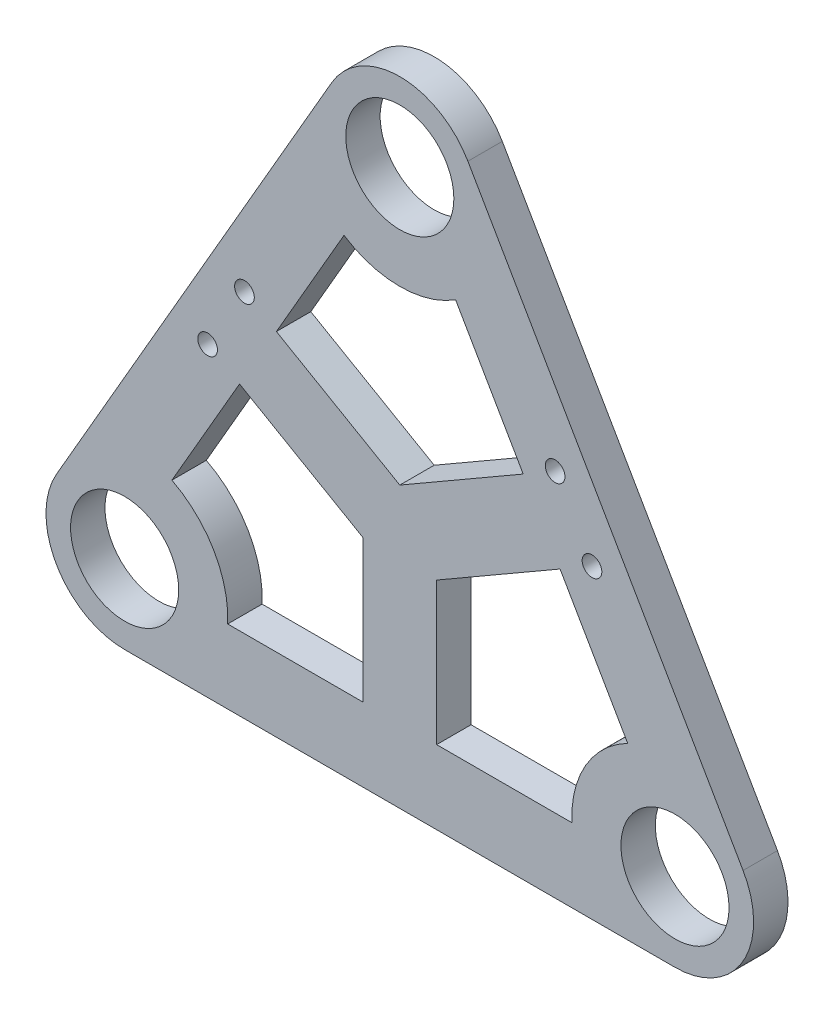
ISO-10303-21;
HEADER;
FILE_DESCRIPTION(('STEP AP214'),'2;1');
FILE_NAME('part.step','',(''),(''),'','','');
FILE_SCHEMA(('AUTOMOTIVE_DESIGN { 1 0 10303 214 1 1 1 1 }'));
ENDSEC;
DATA;
#1=APPLICATION_CONTEXT('core data for automotive mechanical design processes');
#2=APPLICATION_PROTOCOL_DEFINITION('international standard','automotive_design',2000,#1);
#3=PRODUCT_CONTEXT('',#1,'mechanical');
#4=PRODUCT('Part','Part','',(#3));
#5=PRODUCT_RELATED_PRODUCT_CATEGORY('part','',(#4));
#6=PRODUCT_DEFINITION_FORMATION('','',#4);
#7=PRODUCT_DEFINITION_CONTEXT('part definition',#1,'design');
#8=PRODUCT_DEFINITION('design','',#6,#7);
#9=PRODUCT_DEFINITION_SHAPE('','',#8);
#10=(LENGTH_UNIT() NAMED_UNIT(*) SI_UNIT(.MILLI.,.METRE.));
#11=(NAMED_UNIT(*) PLANE_ANGLE_UNIT() SI_UNIT($,.RADIAN.));
#12=(NAMED_UNIT(*) SI_UNIT($,.STERADIAN.) SOLID_ANGLE_UNIT());
#13=UNCERTAINTY_MEASURE_WITH_UNIT(LENGTH_MEASURE(1.E-05),#10,'distance_accuracy_value','');
#14=(GEOMETRIC_REPRESENTATION_CONTEXT(3) GLOBAL_UNCERTAINTY_ASSIGNED_CONTEXT((#13)) GLOBAL_UNIT_ASSIGNED_CONTEXT((#10,
#11,#12)) REPRESENTATION_CONTEXT('',''));
#15=CARTESIAN_POINT('',(0.,0.,0.));
#16=DIRECTION('',(0.,0.,1.));
#17=DIRECTION('',(1.,0.,0.));
#18=AXIS2_PLACEMENT_3D('',#15,#16,#17);
#19=CARTESIAN_POINT('',(56.,96.9948452238571,7.));
#20=DIRECTION('',(0.,0.,1.));
#21=DIRECTION('',(1.,0.,0.));
#22=AXIS2_PLACEMENT_3D('',#19,#20,#21);
#23=PLANE('',#22);
#24=CARTESIAN_POINT('',(95.1112159321677,46.2522320835453,7.));
#25=DIRECTION('',(0.,0.,1.));
#26=DIRECTION('',(1.,0.,0.));
#27=AXIS2_PLACEMENT_3D('',#24,#25,#26);
#28=CIRCLE('',#27,2.);
#29=CARTESIAN_POINT('',(97.1112159321677,46.2522320835453,7.));
#30=VERTEX_POINT('',#29);
#31=EDGE_CURVE('E600',#30,#30,#28,.T.);
#32=ORIENTED_EDGE('',*,*,#31,.F.);
#33=EDGE_LOOP('',(#32));
#34=FACE_BOUND('',#33,.T.);
#35=CARTESIAN_POINT('',(87.6112159321677,59.2426131403119,7.));
#36=DIRECTION('',(0.,0.,1.));
#37=DIRECTION('',(1.,0.,0.));
#38=AXIS2_PLACEMENT_3D('',#35,#36,#37);
#39=CIRCLE('',#38,2.);
#40=CARTESIAN_POINT('',(89.6112159321677,59.2426131403119,7.));
#41=VERTEX_POINT('',#40);
#42=EDGE_CURVE('E590',#41,#41,#39,.T.);
#43=ORIENTED_EDGE('',*,*,#42,.F.);
#44=EDGE_LOOP('',(#43));
#45=FACE_BOUND('',#44,.T.);
#46=CARTESIAN_POINT('',(16.8887840678323,46.2522320835453,7.));
#47=DIRECTION('',(0.,0.,1.));
#48=DIRECTION('',(1.,0.,0.));
#49=AXIS2_PLACEMENT_3D('',#46,#47,#48);
#50=CIRCLE('',#49,2.00000000000001);
#51=CARTESIAN_POINT('',(18.8887840678323,46.2522320835453,7.));
#52=VERTEX_POINT('',#51);
#53=EDGE_CURVE('E581',#52,#52,#50,.T.);
#54=ORIENTED_EDGE('',*,*,#53,.F.);
#55=EDGE_LOOP('',(#54));
#56=FACE_BOUND('',#55,.T.);
#57=CARTESIAN_POINT('',(24.3887840678323,59.2426131403119,7.));
#58=DIRECTION('',(0.,0.,1.));
#59=DIRECTION('',(1.,0.,0.));
#60=AXIS2_PLACEMENT_3D('',#57,#58,#59);
#61=CIRCLE('',#60,2.);
#62=CARTESIAN_POINT('',(26.3887840678323,59.2426131403119,7.));
#63=VERTEX_POINT('',#62);
#64=EDGE_CURVE('E221',#63,#63,#61,.T.);
#65=ORIENTED_EDGE('',*,*,#64,.F.);
#66=EDGE_LOOP('',(#65));
#67=FACE_BOUND('',#66,.T.);
#68=DIRECTION('',(0.,-1.,0.));
#69=VECTOR('',#68,1.);
#70=CARTESIAN_POINT('',(63.5,-0.999999999999997,7.));
#71=LINE('',#70,#69);
#72=CARTESIAN_POINT('',(63.5,28.0014880556968,7.));
#73=VERTEX_POINT('',#72);
#74=CARTESIAN_POINT('',(63.5,-1.,7.));
#75=VERTEX_POINT('',#74);
#76=EDGE_CURVE('E61',#73,#75,#71,.T.);
#77=ORIENTED_EDGE('',*,*,#76,.F.);
#78=DIRECTION('',(-0.866025403784438,-0.5,0.));
#79=VECTOR('',#78,1.);
#80=CARTESIAN_POINT('',(63.5,28.0014880556968,7.));
#81=LINE('',#80,#79);
#82=CARTESIAN_POINT('',(88.6160254037844,42.5022320835453,7.));
#83=VERTEX_POINT('',#82);
#84=EDGE_CURVE('E260',#83,#73,#81,.T.);
#85=ORIENTED_EDGE('',*,*,#84,.F.);
#86=DIRECTION('',(-0.5,0.866025403784439,0.));
#87=VECTOR('',#86,1.);
#88=CARTESIAN_POINT('',(88.6160254037844,42.5022320835453,7.));
#89=LINE('',#88,#87);
#90=CARTESIAN_POINT('',(102.377936922083,18.6659021245849,7.));
#91=VERTEX_POINT('',#90);
#92=EDGE_CURVE('E287',#91,#83,#89,.T.);
#93=ORIENTED_EDGE('',*,*,#92,.F.);
#94=CARTESIAN_POINT('',(112.,0.,7.));
#95=DIRECTION('',(0.,0.,-1.));
#96=DIRECTION('',(1.,0.,0.));
#97=AXIS2_PLACEMENT_3D('',#94,#95,#96);
#98=CIRCLE('',#97,21.);
#99=CARTESIAN_POINT('',(91.023823036597,-0.999999999999997,7.));
#100=VERTEX_POINT('',#99);
#101=EDGE_CURVE('E283',#100,#91,#98,.T.);
#102=ORIENTED_EDGE('',*,*,#101,.F.);
#103=DIRECTION('',(1.,0.,0.));
#104=VECTOR('',#103,1.);
#105=CARTESIAN_POINT('',(63.5,-0.999999999999997,7.));
#106=LINE('',#105,#104);
#107=EDGE_CURVE('E279',#75,#100,#106,.T.);
#108=ORIENTED_EDGE('',*,*,#107,.F.);
#109=EDGE_LOOP('',(#77,#85,#93,#102,#108));
#110=FACE_BOUND('',#109,.T.);
#111=DIRECTION('',(0.866025403784439,-0.5,0.));
#112=VECTOR('',#111,1.);
#113=CARTESIAN_POINT('',(30.8839745962155,55.4926131403119,7.));
#114=LINE('',#113,#112);
#115=CARTESIAN_POINT('',(30.8839745962155,55.4926131403119,7.));
#116=VERTEX_POINT('',#115);
#117=CARTESIAN_POINT('',(56.,40.9918691124634,7.));
#118=VERTEX_POINT('',#117);
#119=EDGE_CURVE('E69',#116,#118,#114,.T.);
#120=ORIENTED_EDGE('',*,*,#119,.F.);
#121=DIRECTION('',(-0.5,-0.866025403784439,0.));
#122=VECTOR('',#121,1.);
#123=CARTESIAN_POINT('',(30.8839745962155,55.4926131403119,7.));
#124=LINE('',#123,#122);
#125=CARTESIAN_POINT('',(44.645886114514,79.3289430992722,7.));
#126=VERTEX_POINT('',#125);
#127=EDGE_CURVE('E214',#126,#116,#124,.T.);
#128=ORIENTED_EDGE('',*,*,#127,.F.);
#129=CARTESIAN_POINT('',(56.,96.9948452238571,7.));
#130=DIRECTION('',(0.,0.,-1.));
#131=DIRECTION('',(1.,0.,0.));
#132=AXIS2_PLACEMENT_3D('',#129,#130,#131);
#133=CIRCLE('',#132,21.);
#134=CARTESIAN_POINT('',(67.3541138854859,79.3289430992722,7.));
#135=VERTEX_POINT('',#134);
#136=EDGE_CURVE('E218',#135,#126,#133,.T.);
#137=ORIENTED_EDGE('',*,*,#136,.F.);
#138=DIRECTION('',(-0.5,0.866025403784439,0.));
#139=VECTOR('',#138,1.);
#140=CARTESIAN_POINT('',(81.1160254037844,55.4926131403119,7.));
#141=LINE('',#140,#139);
#142=CARTESIAN_POINT('',(81.1160254037844,55.4926131403119,7.));
#143=VERTEX_POINT('',#142);
#144=EDGE_CURVE('E237',#143,#135,#141,.T.);
#145=ORIENTED_EDGE('',*,*,#144,.F.);
#146=DIRECTION('',(0.866025403784438,0.5,0.));
#147=VECTOR('',#146,1.);
#148=CARTESIAN_POINT('',(56.,40.9918691124634,7.));
#149=LINE('',#148,#147);
#150=EDGE_CURVE('E233',#118,#143,#149,.T.);
#151=ORIENTED_EDGE('',*,*,#150,.F.);
#152=EDGE_LOOP('',(#120,#128,#137,#145,#151));
#153=FACE_BOUND('',#152,.T.);
#154=CARTESIAN_POINT('',(0.,0.,7.));
#155=DIRECTION('',(0.,0.,-1.));
#156=DIRECTION('',(1.,0.,0.));
#157=AXIS2_PLACEMENT_3D('',#154,#155,#156);
#158=CIRCLE('',#157,21.);
#159=CARTESIAN_POINT('',(9.62206307791709,18.6659021245849,7.));
#160=VERTEX_POINT('',#159);
#161=CARTESIAN_POINT('',(20.976176963403,-1.00000000000001,7.));
#162=VERTEX_POINT('',#161);
#163=EDGE_CURVE('E297',#160,#162,#158,.T.);
#164=ORIENTED_EDGE('',*,*,#163,.F.);
#165=DIRECTION('',(-0.499999999999999,-0.866025403784439,0.));
#166=VECTOR('',#165,1.);
#167=CARTESIAN_POINT('',(9.62206307791709,18.6659021245849,7.));
#168=LINE('',#167,#166);
#169=CARTESIAN_POINT('',(23.3839745962156,42.5022320835453,7.));
#170=VERTEX_POINT('',#169);
#171=EDGE_CURVE('E314',#170,#160,#168,.T.);
#172=ORIENTED_EDGE('',*,*,#171,.F.);
#173=DIRECTION('',(-0.866025403784439,0.5,0.));
#174=VECTOR('',#173,1.);
#175=CARTESIAN_POINT('',(23.3839745962156,42.5022320835453,7.));
#176=LINE('',#175,#174);
#177=CARTESIAN_POINT('',(48.5,28.0014880556969,7.));
#178=VERTEX_POINT('',#177);
#179=EDGE_CURVE('E341',#178,#170,#176,.T.);
#180=ORIENTED_EDGE('',*,*,#179,.F.);
#181=DIRECTION('',(0.,1.,0.));
#182=VECTOR('',#181,1.);
#183=CARTESIAN_POINT('',(48.5,28.0014880556969,7.));
#184=LINE('',#183,#182);
#185=CARTESIAN_POINT('',(48.5,-0.999999999999997,7.));
#186=VERTEX_POINT('',#185);
#187=EDGE_CURVE('E337',#186,#178,#184,.T.);
#188=ORIENTED_EDGE('',*,*,#187,.F.);
#189=DIRECTION('',(1.,0.,0.));
#190=VECTOR('',#189,1.);
#191=CARTESIAN_POINT('',(48.5,-0.999999999999997,7.));
#192=LINE('',#191,#190);
#193=EDGE_CURVE('E333',#162,#186,#192,.T.);
#194=ORIENTED_EDGE('',*,*,#193,.F.);
#195=EDGE_LOOP('',(#164,#172,#180,#188,#194));
#196=FACE_BOUND('',#195,.T.);
#197=CARTESIAN_POINT('',(112.,0.,7.));
#198=DIRECTION('',(0.,0.,1.));
#199=DIRECTION('',(1.,0.,0.));
#200=AXIS2_PLACEMENT_3D('',#197,#198,#199);
#201=CIRCLE('',#200,11.);
#202=CARTESIAN_POINT('',(123.,0.,7.));
#203=VERTEX_POINT('',#202);
#204=EDGE_CURVE('E372',#203,#203,#201,.T.);
#205=ORIENTED_EDGE('',*,*,#204,.F.);
#206=EDGE_LOOP('',(#205));
#207=FACE_BOUND('',#206,.T.);
#208=CARTESIAN_POINT('',(56.,96.9948452238571,7.));
#209=DIRECTION('',(0.,0.,1.));
#210=DIRECTION('',(1.,0.,0.));
#211=AXIS2_PLACEMENT_3D('',#208,#209,#210);
#212=CIRCLE('',#211,16.);
#213=CARTESIAN_POINT('',(69.856406460551,104.994845223857,7.));
#214=VERTEX_POINT('',#213);
#215=CARTESIAN_POINT('',(42.143593539449,104.994845223857,7.));
#216=VERTEX_POINT('',#215);
#217=EDGE_CURVE('E388',#214,#216,#212,.T.);
#218=ORIENTED_EDGE('',*,*,#217,.T.);
#219=DIRECTION('',(-0.5,-0.866025403784439,0.));
#220=VECTOR('',#219,1.);
#221=CARTESIAN_POINT('',(42.143593539449,104.994845223857,7.));
#222=LINE('',#221,#220);
#223=CARTESIAN_POINT('',(-13.856406460551,8.,7.));
#224=VERTEX_POINT('',#223);
#225=EDGE_CURVE('E392',#216,#224,#222,.T.);
#226=ORIENTED_EDGE('',*,*,#225,.T.);
#227=CARTESIAN_POINT('',(0.,0.,7.));
#228=DIRECTION('',(0.,0.,1.));
#229=DIRECTION('',(1.,0.,0.));
#230=AXIS2_PLACEMENT_3D('',#227,#228,#229);
#231=CIRCLE('',#230,16.);
#232=CARTESIAN_POINT('',(0.,-16.,7.));
#233=VERTEX_POINT('',#232);
#234=EDGE_CURVE('E396',#224,#233,#231,.T.);
#235=ORIENTED_EDGE('',*,*,#234,.T.);
#236=DIRECTION('',(1.,0.,0.));
#237=VECTOR('',#236,1.);
#238=CARTESIAN_POINT('',(0.,-16.,7.));
#239=LINE('',#238,#237);
#240=CARTESIAN_POINT('',(112.,-16.,7.));
#241=VERTEX_POINT('',#240);
#242=EDGE_CURVE('E399',#233,#241,#239,.T.);
#243=ORIENTED_EDGE('',*,*,#242,.T.);
#244=CARTESIAN_POINT('',(112.,0.,7.));
#245=DIRECTION('',(0.,0.,1.));
#246=DIRECTION('',(1.,0.,0.));
#247=AXIS2_PLACEMENT_3D('',#244,#245,#246);
#248=CIRCLE('',#247,16.);
#249=CARTESIAN_POINT('',(125.856406460551,8.,7.));
#250=VERTEX_POINT('',#249);
#251=EDGE_CURVE('E402',#241,#250,#248,.T.);
#252=ORIENTED_EDGE('',*,*,#251,.T.);
#253=DIRECTION('',(-0.5,0.866025403784438,0.));
#254=VECTOR('',#253,1.);
#255=CARTESIAN_POINT('',(69.856406460551,104.994845223857,7.));
#256=LINE('',#255,#254);
#257=EDGE_CURVE('E405',#250,#214,#256,.T.);
#258=ORIENTED_EDGE('',*,*,#257,.T.);
#259=EDGE_LOOP('',(#218,#226,#235,#243,#252,#258));
#260=FACE_BOUND('',#259,.T.);
#261=CARTESIAN_POINT('',(0.,0.,7.));
#262=DIRECTION('',(0.,0.,1.));
#263=DIRECTION('',(1.,0.,0.));
#264=AXIS2_PLACEMENT_3D('',#261,#262,#263);
#265=CIRCLE('',#264,11.);
#266=CARTESIAN_POINT('',(11.,0.,7.));
#267=VERTEX_POINT('',#266);
#268=EDGE_CURVE('E380',#267,#267,#265,.T.);
#269=ORIENTED_EDGE('',*,*,#268,.F.);
#270=EDGE_LOOP('',(#269));
#271=FACE_BOUND('',#270,.T.);
#272=CARTESIAN_POINT('',(56.,96.9948452238571,7.));
#273=DIRECTION('',(0.,0.,1.));
#274=DIRECTION('',(1.,0.,0.));
#275=AXIS2_PLACEMENT_3D('',#272,#273,#274);
#276=CIRCLE('',#275,11.);
#277=CARTESIAN_POINT('',(67.,96.9948452238571,7.));
#278=VERTEX_POINT('',#277);
#279=EDGE_CURVE('E364',#278,#278,#276,.T.);
#280=ORIENTED_EDGE('',*,*,#279,.F.);
#281=EDGE_LOOP('',(#280));
#282=FACE_BOUND('',#281,.T.);
#283=ADVANCED_FACE('F45',(#34,#45,#56,#67,#110,#153,#196,#207,#260,#271,#282),#23,.T.);
#284=CARTESIAN_POINT('',(56.,96.9948452238571,0.));
#285=DIRECTION('',(0.,0.,1.));
#286=DIRECTION('',(1.,0.,0.));
#287=AXIS2_PLACEMENT_3D('',#284,#285,#286);
#288=PLANE('',#287);
#289=CARTESIAN_POINT('',(95.1112159321677,46.2522320835453,0.));
#290=DIRECTION('',(0.,0.,1.));
#291=DIRECTION('',(1.,0.,0.));
#292=AXIS2_PLACEMENT_3D('',#289,#290,#291);
#293=CIRCLE('',#292,2.);
#294=CARTESIAN_POINT('',(97.1112159321677,46.2522320835453,0.));
#295=VERTEX_POINT('',#294);
#296=EDGE_CURVE('E596',#295,#295,#293,.T.);
#297=ORIENTED_EDGE('',*,*,#296,.T.);
#298=EDGE_LOOP('',(#297));
#299=FACE_BOUND('',#298,.T.);
#300=CARTESIAN_POINT('',(87.6112159321677,59.2426131403119,0.));
#301=DIRECTION('',(0.,0.,1.));
#302=DIRECTION('',(1.,0.,0.));
#303=AXIS2_PLACEMENT_3D('',#300,#301,#302);
#304=CIRCLE('',#303,2.);
#305=CARTESIAN_POINT('',(89.6112159321677,59.2426131403119,0.));
#306=VERTEX_POINT('',#305);
#307=EDGE_CURVE('E584',#306,#306,#304,.T.);
#308=ORIENTED_EDGE('',*,*,#307,.T.);
#309=EDGE_LOOP('',(#308));
#310=FACE_BOUND('',#309,.T.);
#311=CARTESIAN_POINT('',(16.8887840678323,46.2522320835453,0.));
#312=DIRECTION('',(0.,0.,1.));
#313=DIRECTION('',(1.,0.,0.));
#314=AXIS2_PLACEMENT_3D('',#311,#312,#313);
#315=CIRCLE('',#314,2.00000000000001);
#316=CARTESIAN_POINT('',(18.8887840678323,46.2522320835453,0.));
#317=VERTEX_POINT('',#316);
#318=EDGE_CURVE('E578',#317,#317,#315,.T.);
#319=ORIENTED_EDGE('',*,*,#318,.T.);
#320=EDGE_LOOP('',(#319));
#321=FACE_BOUND('',#320,.T.);
#322=CARTESIAN_POINT('',(24.3887840678323,59.2426131403119,0.));
#323=DIRECTION('',(0.,0.,1.));
#324=DIRECTION('',(1.,0.,0.));
#325=AXIS2_PLACEMENT_3D('',#322,#323,#324);
#326=CIRCLE('',#325,2.);
#327=CARTESIAN_POINT('',(26.3887840678323,59.2426131403119,0.));
#328=VERTEX_POINT('',#327);
#329=EDGE_CURVE('E234',#328,#328,#326,.T.);
#330=ORIENTED_EDGE('',*,*,#329,.T.);
#331=EDGE_LOOP('',(#330));
#332=FACE_BOUND('',#331,.T.);
#333=DIRECTION('',(-0.866025403784438,-0.5,0.));
#334=VECTOR('',#333,1.);
#335=CARTESIAN_POINT('',(63.5,28.0014880556968,0.));
#336=LINE('',#335,#334);
#337=CARTESIAN_POINT('',(88.6160254037844,42.5022320835453,0.));
#338=VERTEX_POINT('',#337);
#339=CARTESIAN_POINT('',(63.5,28.0014880556968,0.));
#340=VERTEX_POINT('',#339);
#341=EDGE_CURVE('E272',#338,#340,#336,.T.);
#342=ORIENTED_EDGE('',*,*,#341,.T.);
#343=DIRECTION('',(0.,-1.,0.));
#344=VECTOR('',#343,1.);
#345=CARTESIAN_POINT('',(63.5,-0.999999999999997,0.));
#346=LINE('',#345,#344);
#347=CARTESIAN_POINT('',(63.5,-0.999999999999997,0.));
#348=VERTEX_POINT('',#347);
#349=EDGE_CURVE('E255',#340,#348,#346,.T.);
#350=ORIENTED_EDGE('',*,*,#349,.T.);
#351=DIRECTION('',(1.,0.,0.));
#352=VECTOR('',#351,1.);
#353=CARTESIAN_POINT('',(63.5,-0.999999999999997,0.));
#354=LINE('',#353,#352);
#355=CARTESIAN_POINT('',(91.023823036597,-1.,0.));
#356=VERTEX_POINT('',#355);
#357=EDGE_CURVE('E259',#348,#356,#354,.T.);
#358=ORIENTED_EDGE('',*,*,#357,.T.);
#359=CARTESIAN_POINT('',(112.,0.,0.));
#360=DIRECTION('',(0.,0.,-1.));
#361=DIRECTION('',(1.,0.,0.));
#362=AXIS2_PLACEMENT_3D('',#359,#360,#361);
#363=CIRCLE('',#362,21.);
#364=CARTESIAN_POINT('',(102.377936922083,18.6659021245849,0.));
#365=VERTEX_POINT('',#364);
#366=EDGE_CURVE('E264',#356,#365,#363,.T.);
#367=ORIENTED_EDGE('',*,*,#366,.T.);
#368=DIRECTION('',(-0.5,0.866025403784439,0.));
#369=VECTOR('',#368,1.);
#370=CARTESIAN_POINT('',(88.6160254037844,42.5022320835453,0.));
#371=LINE('',#370,#369);
#372=EDGE_CURVE('E268',#365,#338,#371,.T.);
#373=ORIENTED_EDGE('',*,*,#372,.T.);
#374=EDGE_LOOP('',(#342,#350,#358,#367,#373));
#375=FACE_BOUND('',#374,.T.);
#376=DIRECTION('',(-0.5,-0.866025403784439,0.));
#377=VECTOR('',#376,1.);
#378=CARTESIAN_POINT('',(30.8839745962155,55.4926131403119,0.));
#379=LINE('',#378,#377);
#380=CARTESIAN_POINT('',(44.645886114514,79.3289430992722,0.));
#381=VERTEX_POINT('',#380);
#382=CARTESIAN_POINT('',(30.8839745962155,55.4926131403119,0.));
#383=VERTEX_POINT('',#382);
#384=EDGE_CURVE('E198',#381,#383,#379,.T.);
#385=ORIENTED_EDGE('',*,*,#384,.T.);
#386=DIRECTION('',(0.866025403784439,-0.5,0.));
#387=VECTOR('',#386,1.);
#388=CARTESIAN_POINT('',(30.8839745962155,55.4926131403119,0.));
#389=LINE('',#388,#387);
#390=CARTESIAN_POINT('',(56.,40.9918691124634,0.));
#391=VERTEX_POINT('',#390);
#392=EDGE_CURVE('E191',#383,#391,#389,.T.);
#393=ORIENTED_EDGE('',*,*,#392,.T.);
#394=DIRECTION('',(0.866025403784438,0.5,0.));
#395=VECTOR('',#394,1.);
#396=CARTESIAN_POINT('',(56.,40.9918691124634,0.));
#397=LINE('',#396,#395);
#398=CARTESIAN_POINT('',(81.1160254037844,55.4926131403119,0.));
#399=VERTEX_POINT('',#398);
#400=EDGE_CURVE('E202',#391,#399,#397,.T.);
#401=ORIENTED_EDGE('',*,*,#400,.T.);
#402=DIRECTION('',(-0.5,0.866025403784439,0.));
#403=VECTOR('',#402,1.);
#404=CARTESIAN_POINT('',(81.1160254037844,55.4926131403119,0.));
#405=LINE('',#404,#403);
#406=CARTESIAN_POINT('',(67.3541138854859,79.3289430992722,0.));
#407=VERTEX_POINT('',#406);
#408=EDGE_CURVE('E207',#399,#407,#405,.T.);
#409=ORIENTED_EDGE('',*,*,#408,.T.);
#410=CARTESIAN_POINT('',(56.,96.9948452238571,0.));
#411=DIRECTION('',(0.,0.,-1.));
#412=DIRECTION('',(1.,0.,0.));
#413=AXIS2_PLACEMENT_3D('',#410,#411,#412);
#414=CIRCLE('',#413,21.);
#415=EDGE_CURVE('E226',#407,#381,#414,.T.);
#416=ORIENTED_EDGE('',*,*,#415,.T.);
#417=EDGE_LOOP('',(#385,#393,#401,#409,#416));
#418=FACE_BOUND('',#417,.T.);
#419=DIRECTION('',(-0.499999999999999,-0.866025403784439,0.));
#420=VECTOR('',#419,1.);
#421=CARTESIAN_POINT('',(9.62206307791709,18.6659021245849,0.));
#422=LINE('',#421,#420);
#423=CARTESIAN_POINT('',(23.3839745962156,42.5022320835453,0.));
#424=VERTEX_POINT('',#423);
#425=CARTESIAN_POINT('',(9.62206307791709,18.6659021245849,0.));
#426=VERTEX_POINT('',#425);
#427=EDGE_CURVE('E326',#424,#426,#422,.T.);
#428=ORIENTED_EDGE('',*,*,#427,.T.);
#429=CARTESIAN_POINT('',(0.,0.,0.));
#430=DIRECTION('',(0.,0.,-1.));
#431=DIRECTION('',(1.,0.,0.));
#432=AXIS2_PLACEMENT_3D('',#429,#430,#431);
#433=CIRCLE('',#432,21.);
#434=CARTESIAN_POINT('',(20.976176963403,-1.,0.));
#435=VERTEX_POINT('',#434);
#436=EDGE_CURVE('E309',#426,#435,#433,.T.);
#437=ORIENTED_EDGE('',*,*,#436,.T.);
#438=DIRECTION('',(1.,0.,0.));
#439=VECTOR('',#438,1.);
#440=CARTESIAN_POINT('',(48.5,-0.999999999999997,0.));
#441=LINE('',#440,#439);
#442=CARTESIAN_POINT('',(48.5,-1.,0.));
#443=VERTEX_POINT('',#442);
#444=EDGE_CURVE('E313',#435,#443,#441,.T.);
#445=ORIENTED_EDGE('',*,*,#444,.T.);
#446=DIRECTION('',(0.,1.,0.));
#447=VECTOR('',#446,1.);
#448=CARTESIAN_POINT('',(48.5,28.0014880556969,0.));
#449=LINE('',#448,#447);
#450=CARTESIAN_POINT('',(48.5,28.0014880556969,0.));
#451=VERTEX_POINT('',#450);
#452=EDGE_CURVE('E318',#443,#451,#449,.T.);
#453=ORIENTED_EDGE('',*,*,#452,.T.);
#454=DIRECTION('',(-0.866025403784439,0.5,0.));
#455=VECTOR('',#454,1.);
#456=CARTESIAN_POINT('',(23.3839745962156,42.5022320835453,0.));
#457=LINE('',#456,#455);
#458=EDGE_CURVE('E322',#451,#424,#457,.T.);
#459=ORIENTED_EDGE('',*,*,#458,.T.);
#460=EDGE_LOOP('',(#428,#437,#445,#453,#459));
#461=FACE_BOUND('',#460,.T.);
#462=CARTESIAN_POINT('',(56.,96.9948452238571,0.));
#463=DIRECTION('',(0.,0.,1.));
#464=DIRECTION('',(1.,0.,0.));
#465=AXIS2_PLACEMENT_3D('',#462,#463,#464);
#466=CIRCLE('',#465,16.);
#467=CARTESIAN_POINT('',(69.856406460551,104.994845223857,0.));
#468=VERTEX_POINT('',#467);
#469=CARTESIAN_POINT('',(42.143593539449,104.994845223857,0.));
#470=VERTEX_POINT('',#469);
#471=EDGE_CURVE('E384',#468,#470,#466,.T.);
#472=ORIENTED_EDGE('',*,*,#471,.F.);
#473=DIRECTION('',(-0.5,0.866025403784438,0.));
#474=VECTOR('',#473,1.);
#475=CARTESIAN_POINT('',(69.856406460551,104.994845223857,0.));
#476=LINE('',#475,#474);
#477=CARTESIAN_POINT('',(125.856406460551,8.,0.));
#478=VERTEX_POINT('',#477);
#479=EDGE_CURVE('E393',#478,#468,#476,.T.);
#480=ORIENTED_EDGE('',*,*,#479,.F.);
#481=CARTESIAN_POINT('',(112.,0.,0.));
#482=DIRECTION('',(0.,0.,1.));
#483=DIRECTION('',(1.,0.,0.));
#484=AXIS2_PLACEMENT_3D('',#481,#482,#483);
#485=CIRCLE('',#484,16.);
#486=CARTESIAN_POINT('',(112.,-16.,0.));
#487=VERTEX_POINT('',#486);
#488=EDGE_CURVE('E421',#487,#478,#485,.T.);
#489=ORIENTED_EDGE('',*,*,#488,.F.);
#490=DIRECTION('',(1.,0.,0.));
#491=VECTOR('',#490,1.);
#492=CARTESIAN_POINT('',(0.,-16.,0.));
#493=LINE('',#492,#491);
#494=CARTESIAN_POINT('',(0.,-16.,0.));
#495=VERTEX_POINT('',#494);
#496=EDGE_CURVE('E418',#495,#487,#493,.T.);
#497=ORIENTED_EDGE('',*,*,#496,.F.);
#498=CARTESIAN_POINT('',(0.,0.,0.));
#499=DIRECTION('',(0.,0.,1.));
#500=DIRECTION('',(1.,0.,0.));
#501=AXIS2_PLACEMENT_3D('',#498,#499,#500);
#502=CIRCLE('',#501,16.);
#503=CARTESIAN_POINT('',(-13.856406460551,8.,0.));
#504=VERTEX_POINT('',#503);
#505=EDGE_CURVE('E415',#504,#495,#502,.T.);
#506=ORIENTED_EDGE('',*,*,#505,.F.);
#507=DIRECTION('',(-0.5,-0.866025403784439,0.));
#508=VECTOR('',#507,1.);
#509=CARTESIAN_POINT('',(42.143593539449,104.994845223857,0.));
#510=LINE('',#509,#508);
#511=EDGE_CURVE('E412',#470,#504,#510,.T.);
#512=ORIENTED_EDGE('',*,*,#511,.F.);
#513=EDGE_LOOP('',(#472,#480,#489,#497,#506,#512));
#514=FACE_BOUND('',#513,.T.);
#515=CARTESIAN_POINT('',(0.,0.,0.));
#516=DIRECTION('',(0.,0.,1.));
#517=DIRECTION('',(1.,0.,0.));
#518=AXIS2_PLACEMENT_3D('',#515,#516,#517);
#519=CIRCLE('',#518,11.);
#520=CARTESIAN_POINT('',(11.,0.,0.));
#521=VERTEX_POINT('',#520);
#522=EDGE_CURVE('E376',#521,#521,#519,.T.);
#523=ORIENTED_EDGE('',*,*,#522,.T.);
#524=EDGE_LOOP('',(#523));
#525=FACE_BOUND('',#524,.T.);
#526=CARTESIAN_POINT('',(112.,0.,0.));
#527=DIRECTION('',(0.,0.,1.));
#528=DIRECTION('',(1.,0.,0.));
#529=AXIS2_PLACEMENT_3D('',#526,#527,#528);
#530=CIRCLE('',#529,11.);
#531=CARTESIAN_POINT('',(123.,0.,0.));
#532=VERTEX_POINT('',#531);
#533=EDGE_CURVE('E368',#532,#532,#530,.T.);
#534=ORIENTED_EDGE('',*,*,#533,.T.);
#535=EDGE_LOOP('',(#534));
#536=FACE_BOUND('',#535,.T.);
#537=CARTESIAN_POINT('',(56.,96.9948452238571,0.));
#538=DIRECTION('',(0.,0.,1.));
#539=DIRECTION('',(1.,0.,0.));
#540=AXIS2_PLACEMENT_3D('',#537,#538,#539);
#541=CIRCLE('',#540,11.);
#542=CARTESIAN_POINT('',(67.,96.9948452238571,0.));
#543=VERTEX_POINT('',#542);
#544=EDGE_CURVE('E351',#543,#543,#541,.T.);
#545=ORIENTED_EDGE('',*,*,#544,.T.);
#546=EDGE_LOOP('',(#545));
#547=FACE_BOUND('',#546,.T.);
#548=ADVANCED_FACE('F209',(#299,#310,#321,#332,#375,#418,#461,#514,#525,#536,#547),#288,.F.);
#549=CARTESIAN_POINT('',(56.,96.9948452238571,7.));
#550=DIRECTION('',(0.,0.,-1.));
#551=DIRECTION('',(-1.,0.,0.));
#552=AXIS2_PLACEMENT_3D('',#549,#550,#551);
#553=CYLINDRICAL_SURFACE('',#552,16.);
#554=ORIENTED_EDGE('',*,*,#471,.T.);
#555=DIRECTION('',(0.,0.,-1.));
#556=VECTOR('',#555,1.);
#557=CARTESIAN_POINT('',(42.143593539449,104.994845223857,7.));
#558=LINE('',#557,#556);
#559=EDGE_CURVE('E11',#216,#470,#558,.T.);
#560=ORIENTED_EDGE('',*,*,#559,.F.);
#561=ORIENTED_EDGE('',*,*,#217,.F.);
#562=DIRECTION('',(0.,0.,-1.));
#563=VECTOR('',#562,1.);
#564=CARTESIAN_POINT('',(69.856406460551,104.994845223857,7.));
#565=LINE('',#564,#563);
#566=EDGE_CURVE('E408',#214,#468,#565,.T.);
#567=ORIENTED_EDGE('',*,*,#566,.T.);
#568=EDGE_LOOP('',(#554,#560,#561,#567));
#569=FACE_BOUND('',#568,.T.);
#570=ADVANCED_FACE('F47',(#569),#553,.T.);
#571=CARTESIAN_POINT('',(42.143593539449,104.994845223857,7.));
#572=DIRECTION('',(0.866025403784439,-0.5,0.));
#573=DIRECTION('',(0.5,0.866025403784439,0.));
#574=AXIS2_PLACEMENT_3D('',#571,#572,#573);
#575=PLANE('',#574);
#576=ORIENTED_EDGE('',*,*,#511,.T.);
#577=DIRECTION('',(0.,0.,-1.));
#578=VECTOR('',#577,1.);
#579=CARTESIAN_POINT('',(-13.856406460551,8.,7.));
#580=LINE('',#579,#578);
#581=EDGE_CURVE('E54',#224,#504,#580,.T.);
#582=ORIENTED_EDGE('',*,*,#581,.F.);
#583=ORIENTED_EDGE('',*,*,#225,.F.);
#584=ORIENTED_EDGE('',*,*,#559,.T.);
#585=EDGE_LOOP('',(#576,#582,#583,#584));
#586=FACE_BOUND('',#585,.T.);
#587=ADVANCED_FACE('F469',(#586),#575,.F.);
#588=CARTESIAN_POINT('',(0.,0.,7.));
#589=DIRECTION('',(0.,0.,-1.));
#590=DIRECTION('',(-1.,0.,0.));
#591=AXIS2_PLACEMENT_3D('',#588,#589,#590);
#592=CYLINDRICAL_SURFACE('',#591,16.);
#593=ORIENTED_EDGE('',*,*,#505,.T.);
#594=DIRECTION('',(0.,0.,-1.));
#595=VECTOR('',#594,1.);
#596=CARTESIAN_POINT('',(0.,-16.,7.));
#597=LINE('',#596,#595);
#598=EDGE_CURVE('E437',#233,#495,#597,.T.);
#599=ORIENTED_EDGE('',*,*,#598,.F.);
#600=ORIENTED_EDGE('',*,*,#234,.F.);
#601=ORIENTED_EDGE('',*,*,#581,.T.);
#602=EDGE_LOOP('',(#593,#599,#600,#601));
#603=FACE_BOUND('',#602,.T.);
#604=ADVANCED_FACE('F446',(#603),#592,.T.);
#605=CARTESIAN_POINT('',(0.,-16.,7.));
#606=DIRECTION('',(0.,1.,0.));
#607=DIRECTION('',(0.,0.,1.));
#608=AXIS2_PLACEMENT_3D('',#605,#606,#607);
#609=PLANE('',#608);
#610=ORIENTED_EDGE('',*,*,#496,.T.);
#611=DIRECTION('',(0.,0.,-1.));
#612=VECTOR('',#611,1.);
#613=CARTESIAN_POINT('',(112.,-16.,7.));
#614=LINE('',#613,#612);
#615=EDGE_CURVE('E433',#241,#487,#614,.T.);
#616=ORIENTED_EDGE('',*,*,#615,.F.);
#617=ORIENTED_EDGE('',*,*,#242,.F.);
#618=ORIENTED_EDGE('',*,*,#598,.T.);
#619=EDGE_LOOP('',(#610,#616,#617,#618));
#620=FACE_BOUND('',#619,.T.);
#621=ADVANCED_FACE('F457',(#620),#609,.F.);
#622=CARTESIAN_POINT('',(112.,0.,7.));
#623=DIRECTION('',(0.,0.,-1.));
#624=DIRECTION('',(-1.,0.,0.));
#625=AXIS2_PLACEMENT_3D('',#622,#623,#624);
#626=CYLINDRICAL_SURFACE('',#625,16.);
#627=ORIENTED_EDGE('',*,*,#488,.T.);
#628=DIRECTION('',(0.,0.,-1.));
#629=VECTOR('',#628,1.);
#630=CARTESIAN_POINT('',(125.856406460551,8.,7.));
#631=LINE('',#630,#629);
#632=EDGE_CURVE('E429',#250,#478,#631,.T.);
#633=ORIENTED_EDGE('',*,*,#632,.F.);
#634=ORIENTED_EDGE('',*,*,#251,.F.);
#635=ORIENTED_EDGE('',*,*,#615,.T.);
#636=EDGE_LOOP('',(#627,#633,#634,#635));
#637=FACE_BOUND('',#636,.T.);
#638=ADVANCED_FACE('F461',(#637),#626,.T.);
#639=CARTESIAN_POINT('',(69.856406460551,104.994845223857,7.));
#640=DIRECTION('',(-0.866025403784438,-0.5,0.));
#641=DIRECTION('',(0.5,-0.866025403784439,0.));
#642=AXIS2_PLACEMENT_3D('',#639,#640,#641);
#643=PLANE('',#642);
#644=ORIENTED_EDGE('',*,*,#479,.T.);
#645=ORIENTED_EDGE('',*,*,#566,.F.);
#646=ORIENTED_EDGE('',*,*,#257,.F.);
#647=ORIENTED_EDGE('',*,*,#632,.T.);
#648=EDGE_LOOP('',(#644,#645,#646,#647));
#649=FACE_BOUND('',#648,.T.);
#650=ADVANCED_FACE('F472',(#649),#643,.F.);
#651=CARTESIAN_POINT('',(0.,0.,7.));
#652=DIRECTION('',(0.,0.,-1.));
#653=DIRECTION('',(-1.,0.,0.));
#654=AXIS2_PLACEMENT_3D('',#651,#652,#653);
#655=CYLINDRICAL_SURFACE('',#654,11.);
#656=ORIENTED_EDGE('',*,*,#268,.T.);
#657=EDGE_LOOP('',(#656));
#658=FACE_BOUND('',#657,.T.);
#659=ORIENTED_EDGE('',*,*,#522,.F.);
#660=EDGE_LOOP('',(#659));
#661=FACE_BOUND('',#660,.T.);
#662=ADVANCED_FACE('F474',(#658,#661),#655,.F.);
#663=CARTESIAN_POINT('',(112.,0.,7.));
#664=DIRECTION('',(0.,0.,-1.));
#665=DIRECTION('',(-1.,0.,0.));
#666=AXIS2_PLACEMENT_3D('',#663,#664,#665);
#667=CYLINDRICAL_SURFACE('',#666,11.);
#668=ORIENTED_EDGE('',*,*,#204,.T.);
#669=EDGE_LOOP('',(#668));
#670=FACE_BOUND('',#669,.T.);
#671=ORIENTED_EDGE('',*,*,#533,.F.);
#672=EDGE_LOOP('',(#671));
#673=FACE_BOUND('',#672,.T.);
#674=ADVANCED_FACE('F480',(#670,#673),#667,.F.);
#675=CARTESIAN_POINT('',(56.,96.9948452238571,7.));
#676=DIRECTION('',(0.,0.,-1.));
#677=DIRECTION('',(-1.,0.,0.));
#678=AXIS2_PLACEMENT_3D('',#675,#676,#677);
#679=CYLINDRICAL_SURFACE('',#678,11.);
#680=ORIENTED_EDGE('',*,*,#279,.T.);
#681=EDGE_LOOP('',(#680));
#682=FACE_BOUND('',#681,.T.);
#683=ORIENTED_EDGE('',*,*,#544,.F.);
#684=EDGE_LOOP('',(#683));
#685=FACE_BOUND('',#684,.T.);
#686=ADVANCED_FACE('F498',(#682,#685),#679,.F.);
#687=CARTESIAN_POINT('',(0.,0.,0.));
#688=DIRECTION('',(0.,0.,1.));
#689=DIRECTION('',(1.,0.,0.));
#690=AXIS2_PLACEMENT_3D('',#687,#688,#689);
#691=CYLINDRICAL_SURFACE('',#690,21.);
#692=ORIENTED_EDGE('',*,*,#163,.T.);
#693=DIRECTION('',(0.,0.,1.));
#694=VECTOR('',#693,1.);
#695=CARTESIAN_POINT('',(20.976176963403,-1.,0.));
#696=LINE('',#695,#694);
#697=EDGE_CURVE('E330',#435,#162,#696,.T.);
#698=ORIENTED_EDGE('',*,*,#697,.F.);
#699=ORIENTED_EDGE('',*,*,#436,.F.);
#700=DIRECTION('',(0.,0.,1.));
#701=VECTOR('',#700,1.);
#702=CARTESIAN_POINT('',(9.62206307791709,18.6659021245849,0.));
#703=LINE('',#702,#701);
#704=EDGE_CURVE('E348',#426,#160,#703,.T.);
#705=ORIENTED_EDGE('',*,*,#704,.T.);
#706=EDGE_LOOP('',(#692,#698,#699,#705));
#707=FACE_BOUND('',#706,.T.);
#708=ADVANCED_FACE('F502',(#707),#691,.T.);
#709=CARTESIAN_POINT('',(9.62206307791709,18.6659021245849,0.));
#710=DIRECTION('',(-0.866025403784439,0.499999999999999,0.));
#711=DIRECTION('',(-0.499999999999999,-0.866025403784439,0.));
#712=AXIS2_PLACEMENT_3D('',#709,#710,#711);
#713=PLANE('',#712);
#714=ORIENTED_EDGE('',*,*,#171,.T.);
#715=ORIENTED_EDGE('',*,*,#704,.F.);
#716=ORIENTED_EDGE('',*,*,#427,.F.);
#717=DIRECTION('',(0.,0.,1.));
#718=VECTOR('',#717,1.);
#719=CARTESIAN_POINT('',(23.3839745962156,42.5022320835453,0.));
#720=LINE('',#719,#718);
#721=EDGE_CURVE('E352',#424,#170,#720,.T.);
#722=ORIENTED_EDGE('',*,*,#721,.T.);
#723=EDGE_LOOP('',(#714,#715,#716,#722));
#724=FACE_BOUND('',#723,.T.);
#725=ADVANCED_FACE('F506',(#724),#713,.F.);
#726=CARTESIAN_POINT('',(23.3839745962156,42.5022320835453,0.));
#727=DIRECTION('',(0.5,0.866025403784439,0.));
#728=DIRECTION('',(-0.866025403784439,0.5,0.));
#729=AXIS2_PLACEMENT_3D('',#726,#727,#728);
#730=PLANE('',#729);
#731=ORIENTED_EDGE('',*,*,#179,.T.);
#732=ORIENTED_EDGE('',*,*,#721,.F.);
#733=ORIENTED_EDGE('',*,*,#458,.F.);
#734=DIRECTION('',(0.,0.,1.));
#735=VECTOR('',#734,1.);
#736=CARTESIAN_POINT('',(48.5,28.0014880556969,0.));
#737=LINE('',#736,#735);
#738=EDGE_CURVE('E355',#451,#178,#737,.T.);
#739=ORIENTED_EDGE('',*,*,#738,.T.);
#740=EDGE_LOOP('',(#731,#732,#733,#739));
#741=FACE_BOUND('',#740,.T.);
#742=ADVANCED_FACE('F515',(#741),#730,.F.);
#743=CARTESIAN_POINT('',(48.5,28.0014880556969,0.));
#744=DIRECTION('',(1.,0.,0.));
#745=DIRECTION('',(0.,0.,-1.));
#746=AXIS2_PLACEMENT_3D('',#743,#744,#745);
#747=PLANE('',#746);
#748=ORIENTED_EDGE('',*,*,#187,.T.);
#749=ORIENTED_EDGE('',*,*,#738,.F.);
#750=ORIENTED_EDGE('',*,*,#452,.F.);
#751=DIRECTION('',(0.,0.,1.));
#752=VECTOR('',#751,1.);
#753=CARTESIAN_POINT('',(48.5,-0.999999999999997,0.));
#754=LINE('',#753,#752);
#755=EDGE_CURVE('E358',#443,#186,#754,.T.);
#756=ORIENTED_EDGE('',*,*,#755,.T.);
#757=EDGE_LOOP('',(#748,#749,#750,#756));
#758=FACE_BOUND('',#757,.T.);
#759=ADVANCED_FACE('F511',(#758),#747,.F.);
#760=CARTESIAN_POINT('',(48.5,-0.999999999999997,0.));
#761=DIRECTION('',(0.,-1.,0.));
#762=DIRECTION('',(1.,0.,0.));
#763=AXIS2_PLACEMENT_3D('',#760,#761,#762);
#764=PLANE('',#763);
#765=ORIENTED_EDGE('',*,*,#193,.T.);
#766=ORIENTED_EDGE('',*,*,#755,.F.);
#767=ORIENTED_EDGE('',*,*,#444,.F.);
#768=ORIENTED_EDGE('',*,*,#697,.T.);
#769=EDGE_LOOP('',(#765,#766,#767,#768));
#770=FACE_BOUND('',#769,.T.);
#771=ADVANCED_FACE('F508',(#770),#764,.F.);
#772=CARTESIAN_POINT('',(30.8839745962155,55.4926131403119,0.));
#773=DIRECTION('',(-0.5,-0.866025403784439,0.));
#774=DIRECTION('',(0.866025403784439,-0.5,0.));
#775=AXIS2_PLACEMENT_3D('',#772,#773,#774);
#776=PLANE('',#775);
#777=ORIENTED_EDGE('',*,*,#119,.T.);
#778=DIRECTION('',(0.,0.,1.));
#779=VECTOR('',#778,1.);
#780=CARTESIAN_POINT('',(56.,40.9918691124634,0.));
#781=LINE('',#780,#779);
#782=EDGE_CURVE('E187',#391,#118,#781,.T.);
#783=ORIENTED_EDGE('',*,*,#782,.F.);
#784=ORIENTED_EDGE('',*,*,#392,.F.);
#785=DIRECTION('',(0.,0.,1.));
#786=VECTOR('',#785,1.);
#787=CARTESIAN_POINT('',(30.8839745962155,55.4926131403119,0.));
#788=LINE('',#787,#786);
#789=EDGE_CURVE('E244',#383,#116,#788,.T.);
#790=ORIENTED_EDGE('',*,*,#789,.T.);
#791=EDGE_LOOP('',(#777,#783,#784,#790));
#792=FACE_BOUND('',#791,.T.);
#793=ADVANCED_FACE('F189',(#792),#776,.F.);
#794=CARTESIAN_POINT('',(30.8839745962155,55.4926131403119,0.));
#795=DIRECTION('',(-0.866025403784439,0.5,0.));
#796=DIRECTION('',(-0.5,-0.866025403784439,0.));
#797=AXIS2_PLACEMENT_3D('',#794,#795,#796);
#798=PLANE('',#797);
#799=ORIENTED_EDGE('',*,*,#127,.T.);
#800=ORIENTED_EDGE('',*,*,#789,.F.);
#801=ORIENTED_EDGE('',*,*,#384,.F.);
#802=DIRECTION('',(0.,0.,1.));
#803=VECTOR('',#802,1.);
#804=CARTESIAN_POINT('',(44.645886114514,79.3289430992722,0.));
#805=LINE('',#804,#803);
#806=EDGE_CURVE('E247',#381,#126,#805,.T.);
#807=ORIENTED_EDGE('',*,*,#806,.T.);
#808=EDGE_LOOP('',(#799,#800,#801,#807));
#809=FACE_BOUND('',#808,.T.);
#810=ADVANCED_FACE('F545',(#809),#798,.F.);
#811=CARTESIAN_POINT('',(56.,96.9948452238571,0.));
#812=DIRECTION('',(0.,0.,1.));
#813=DIRECTION('',(1.,0.,0.));
#814=AXIS2_PLACEMENT_3D('',#811,#812,#813);
#815=CYLINDRICAL_SURFACE('',#814,21.);
#816=ORIENTED_EDGE('',*,*,#136,.T.);
#817=ORIENTED_EDGE('',*,*,#806,.F.);
#818=ORIENTED_EDGE('',*,*,#415,.F.);
#819=DIRECTION('',(0.,0.,1.));
#820=VECTOR('',#819,1.);
#821=CARTESIAN_POINT('',(67.3541138854859,79.3289430992722,0.));
#822=LINE('',#821,#820);
#823=EDGE_CURVE('E250',#407,#135,#822,.T.);
#824=ORIENTED_EDGE('',*,*,#823,.T.);
#825=EDGE_LOOP('',(#816,#817,#818,#824));
#826=FACE_BOUND('',#825,.T.);
#827=ADVANCED_FACE('F551',(#826),#815,.T.);
#828=CARTESIAN_POINT('',(81.1160254037844,55.4926131403119,0.));
#829=DIRECTION('',(0.866025403784439,0.5,0.));
#830=DIRECTION('',(-0.5,0.866025403784439,0.));
#831=AXIS2_PLACEMENT_3D('',#828,#829,#830);
#832=PLANE('',#831);
#833=ORIENTED_EDGE('',*,*,#144,.T.);
#834=ORIENTED_EDGE('',*,*,#823,.F.);
#835=ORIENTED_EDGE('',*,*,#408,.F.);
#836=DIRECTION('',(0.,0.,1.));
#837=VECTOR('',#836,1.);
#838=CARTESIAN_POINT('',(81.1160254037844,55.4926131403119,0.));
#839=LINE('',#838,#837);
#840=EDGE_CURVE('E197',#399,#143,#839,.T.);
#841=ORIENTED_EDGE('',*,*,#840,.T.);
#842=EDGE_LOOP('',(#833,#834,#835,#841));
#843=FACE_BOUND('',#842,.T.);
#844=ADVANCED_FACE('F548',(#843),#832,.F.);
#845=CARTESIAN_POINT('',(56.,40.9918691124634,0.));
#846=DIRECTION('',(0.5,-0.866025403784438,0.));
#847=DIRECTION('',(0.866025403784439,0.5,0.));
#848=AXIS2_PLACEMENT_3D('',#845,#846,#847);
#849=PLANE('',#848);
#850=ORIENTED_EDGE('',*,*,#150,.T.);
#851=ORIENTED_EDGE('',*,*,#840,.F.);
#852=ORIENTED_EDGE('',*,*,#400,.F.);
#853=ORIENTED_EDGE('',*,*,#782,.T.);
#854=EDGE_LOOP('',(#850,#851,#852,#853));
#855=FACE_BOUND('',#854,.T.);
#856=ADVANCED_FACE('F203',(#855),#849,.F.);
#857=CARTESIAN_POINT('',(63.5,-0.999999999999997,0.));
#858=DIRECTION('',(-1.,0.,0.));
#859=DIRECTION('',(0.,0.,1.));
#860=AXIS2_PLACEMENT_3D('',#857,#858,#859);
#861=PLANE('',#860);
#862=ORIENTED_EDGE('',*,*,#76,.T.);
#863=DIRECTION('',(0.,0.,1.));
#864=VECTOR('',#863,1.);
#865=CARTESIAN_POINT('',(63.5,-0.999999999999997,0.));
#866=LINE('',#865,#864);
#867=EDGE_CURVE('E276',#348,#75,#866,.T.);
#868=ORIENTED_EDGE('',*,*,#867,.F.);
#869=ORIENTED_EDGE('',*,*,#349,.F.);
#870=DIRECTION('',(0.,0.,1.));
#871=VECTOR('',#870,1.);
#872=CARTESIAN_POINT('',(63.5,28.0014880556968,0.));
#873=LINE('',#872,#871);
#874=EDGE_CURVE('E294',#340,#73,#873,.T.);
#875=ORIENTED_EDGE('',*,*,#874,.T.);
#876=EDGE_LOOP('',(#862,#868,#869,#875));
#877=FACE_BOUND('',#876,.T.);
#878=ADVANCED_FACE('F523',(#877),#861,.F.);
#879=CARTESIAN_POINT('',(63.5,28.0014880556968,0.));
#880=DIRECTION('',(-0.5,0.866025403784438,0.));
#881=DIRECTION('',(-0.866025403784438,-0.5,0.));
#882=AXIS2_PLACEMENT_3D('',#879,#880,#881);
#883=PLANE('',#882);
#884=ORIENTED_EDGE('',*,*,#84,.T.);
#885=ORIENTED_EDGE('',*,*,#874,.F.);
#886=ORIENTED_EDGE('',*,*,#341,.F.);
#887=DIRECTION('',(0.,0.,1.));
#888=VECTOR('',#887,1.);
#889=CARTESIAN_POINT('',(88.6160254037844,42.5022320835453,0.));
#890=LINE('',#889,#888);
#891=EDGE_CURVE('E298',#338,#83,#890,.T.);
#892=ORIENTED_EDGE('',*,*,#891,.T.);
#893=EDGE_LOOP('',(#884,#885,#886,#892));
#894=FACE_BOUND('',#893,.T.);
#895=ADVANCED_FACE('F526',(#894),#883,.F.);
#896=CARTESIAN_POINT('',(88.6160254037844,42.5022320835453,0.));
#897=DIRECTION('',(0.866025403784439,0.5,0.));
#898=DIRECTION('',(-0.5,0.866025403784439,0.));
#899=AXIS2_PLACEMENT_3D('',#896,#897,#898);
#900=PLANE('',#899);
#901=ORIENTED_EDGE('',*,*,#92,.T.);
#902=ORIENTED_EDGE('',*,*,#891,.F.);
#903=ORIENTED_EDGE('',*,*,#372,.F.);
#904=DIRECTION('',(0.,0.,1.));
#905=VECTOR('',#904,1.);
#906=CARTESIAN_POINT('',(102.377936922083,18.6659021245849,0.));
#907=LINE('',#906,#905);
#908=EDGE_CURVE('E301',#365,#91,#907,.T.);
#909=ORIENTED_EDGE('',*,*,#908,.T.);
#910=EDGE_LOOP('',(#901,#902,#903,#909));
#911=FACE_BOUND('',#910,.T.);
#912=ADVANCED_FACE('F535',(#911),#900,.F.);
#913=CARTESIAN_POINT('',(112.,0.,0.));
#914=DIRECTION('',(0.,0.,1.));
#915=DIRECTION('',(1.,0.,0.));
#916=AXIS2_PLACEMENT_3D('',#913,#914,#915);
#917=CYLINDRICAL_SURFACE('',#916,21.);
#918=ORIENTED_EDGE('',*,*,#101,.T.);
#919=ORIENTED_EDGE('',*,*,#908,.F.);
#920=ORIENTED_EDGE('',*,*,#366,.F.);
#921=DIRECTION('',(0.,0.,1.));
#922=VECTOR('',#921,1.);
#923=CARTESIAN_POINT('',(91.023823036597,-0.999999999999997,0.));
#924=LINE('',#923,#922);
#925=EDGE_CURVE('E304',#356,#100,#924,.T.);
#926=ORIENTED_EDGE('',*,*,#925,.T.);
#927=EDGE_LOOP('',(#918,#919,#920,#926));
#928=FACE_BOUND('',#927,.T.);
#929=ADVANCED_FACE('F531',(#928),#917,.T.);
#930=CARTESIAN_POINT('',(63.5,-0.999999999999997,0.));
#931=DIRECTION('',(0.,-1.,0.));
#932=DIRECTION('',(1.,0.,0.));
#933=AXIS2_PLACEMENT_3D('',#930,#931,#932);
#934=PLANE('',#933);
#935=ORIENTED_EDGE('',*,*,#107,.T.);
#936=ORIENTED_EDGE('',*,*,#925,.F.);
#937=ORIENTED_EDGE('',*,*,#357,.F.);
#938=ORIENTED_EDGE('',*,*,#867,.T.);
#939=EDGE_LOOP('',(#935,#936,#937,#938));
#940=FACE_BOUND('',#939,.T.);
#941=ADVANCED_FACE('F527',(#940),#934,.F.);
#942=CARTESIAN_POINT('',(24.3887840678323,59.2426131403119,0.));
#943=DIRECTION('',(0.,0.,1.));
#944=DIRECTION('',(1.,0.,0.));
#945=AXIS2_PLACEMENT_3D('',#942,#943,#944);
#946=CYLINDRICAL_SURFACE('',#945,2.);
#947=ORIENTED_EDGE('',*,*,#329,.F.);
#948=EDGE_LOOP('',(#947));
#949=FACE_BOUND('',#948,.T.);
#950=ORIENTED_EDGE('',*,*,#64,.T.);
#951=EDGE_LOOP('',(#950));
#952=FACE_BOUND('',#951,.T.);
#953=ADVANCED_FACE('F530',(#949,#952),#946,.F.);
#954=CARTESIAN_POINT('',(16.8887840678323,46.2522320835453,0.));
#955=DIRECTION('',(0.,0.,1.));
#956=DIRECTION('',(1.,0.,0.));
#957=AXIS2_PLACEMENT_3D('',#954,#955,#956);
#958=CYLINDRICAL_SURFACE('',#957,2.00000000000001);
#959=ORIENTED_EDGE('',*,*,#318,.F.);
#960=EDGE_LOOP('',(#959));
#961=FACE_BOUND('',#960,.T.);
#962=ORIENTED_EDGE('',*,*,#53,.T.);
#963=EDGE_LOOP('',(#962));
#964=FACE_BOUND('',#963,.T.);
#965=ADVANCED_FACE('F561',(#961,#964),#958,.F.);
#966=CARTESIAN_POINT('',(87.6112159321677,59.2426131403119,0.));
#967=DIRECTION('',(0.,0.,1.));
#968=DIRECTION('',(1.,0.,0.));
#969=AXIS2_PLACEMENT_3D('',#966,#967,#968);
#970=CYLINDRICAL_SURFACE('',#969,2.);
#971=ORIENTED_EDGE('',*,*,#307,.F.);
#972=EDGE_LOOP('',(#971));
#973=FACE_BOUND('',#972,.T.);
#974=ORIENTED_EDGE('',*,*,#42,.T.);
#975=EDGE_LOOP('',(#974));
#976=FACE_BOUND('',#975,.T.);
#977=ADVANCED_FACE('F566',(#973,#976),#970,.F.);
#978=CARTESIAN_POINT('',(95.1112159321677,46.2522320835453,0.));
#979=DIRECTION('',(0.,0.,1.));
#980=DIRECTION('',(1.,0.,0.));
#981=AXIS2_PLACEMENT_3D('',#978,#979,#980);
#982=CYLINDRICAL_SURFACE('',#981,2.);
#983=ORIENTED_EDGE('',*,*,#296,.F.);
#984=EDGE_LOOP('',(#983));
#985=FACE_BOUND('',#984,.T.);
#986=ORIENTED_EDGE('',*,*,#31,.T.);
#987=EDGE_LOOP('',(#986));
#988=FACE_BOUND('',#987,.T.);
#989=ADVANCED_FACE('F563',(#985,#988),#982,.F.);
#990=CLOSED_SHELL('',(#283,#548,#570,#587,#604,#621,#638,#650,#662,#674,#686,#708,#725,#742,
#759,#771,#793,#810,#827,#844,#856,#878,#895,#912,#929,#941,#953,#965,#977,#989));
#991=MANIFOLD_SOLID_BREP('B2',#990);
#992=ADVANCED_BREP_SHAPE_REPRESENTATION('',(#18,#991),#14);
#993=SHAPE_DEFINITION_REPRESENTATION(#9,#992);
ENDSEC;
END-ISO-10303-21;
